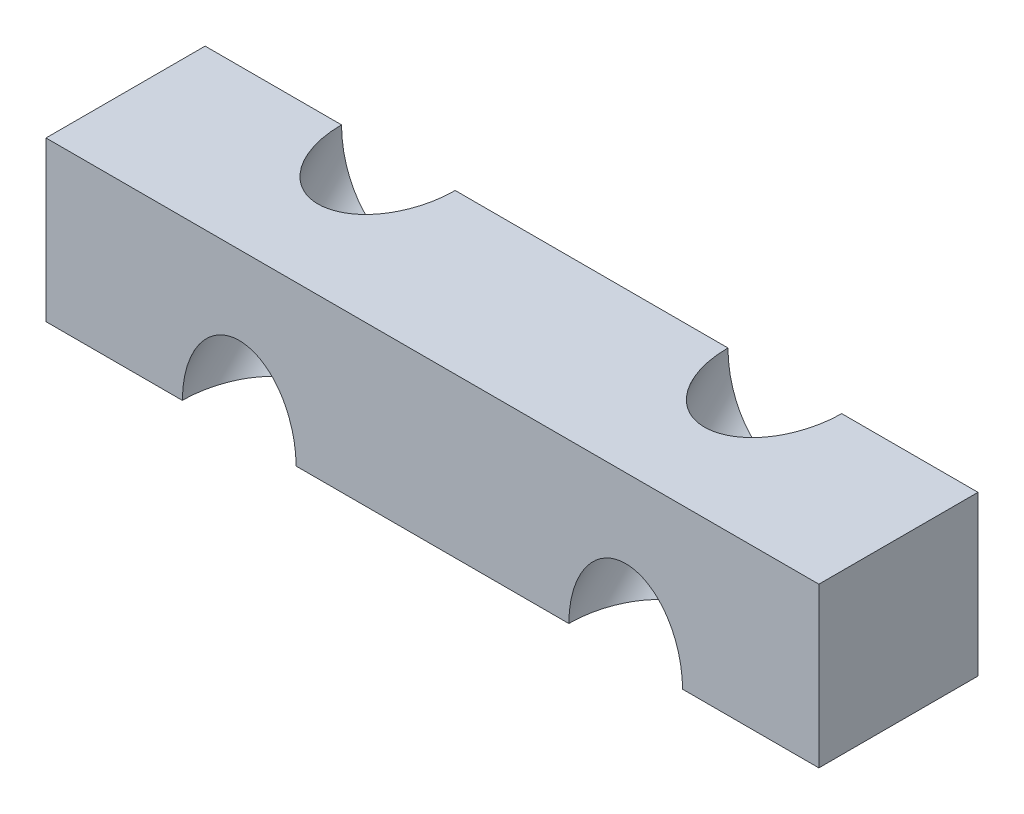
ISO-10303-21;
HEADER;
FILE_DESCRIPTION(('STEP AP214'),'2;1');
FILE_NAME('part.step','',(''),(''),'','','');
FILE_SCHEMA(('AUTOMOTIVE_DESIGN { 1 0 10303 214 1 1 1 1 }'));
ENDSEC;
DATA;
#1=APPLICATION_CONTEXT('core data for automotive mechanical design processes');
#2=APPLICATION_PROTOCOL_DEFINITION('international standard','automotive_design',2000,#1);
#3=PRODUCT_CONTEXT('',#1,'mechanical');
#4=PRODUCT('Part','Part','',(#3));
#5=PRODUCT_RELATED_PRODUCT_CATEGORY('part','',(#4));
#6=PRODUCT_DEFINITION_FORMATION('','',#4);
#7=PRODUCT_DEFINITION_CONTEXT('part definition',#1,'design');
#8=PRODUCT_DEFINITION('design','',#6,#7);
#9=PRODUCT_DEFINITION_SHAPE('','',#8);
#10=(LENGTH_UNIT() NAMED_UNIT(*) SI_UNIT(.MILLI.,.METRE.));
#11=(NAMED_UNIT(*) PLANE_ANGLE_UNIT() SI_UNIT($,.RADIAN.));
#12=(NAMED_UNIT(*) SI_UNIT($,.STERADIAN.) SOLID_ANGLE_UNIT());
#13=UNCERTAINTY_MEASURE_WITH_UNIT(LENGTH_MEASURE(1.E-05),#10,'distance_accuracy_value','');
#14=(GEOMETRIC_REPRESENTATION_CONTEXT(3) GLOBAL_UNCERTAINTY_ASSIGNED_CONTEXT((#13)) GLOBAL_UNIT_ASSIGNED_CONTEXT((#10,
#11,#12)) REPRESENTATION_CONTEXT('',''));
#15=CARTESIAN_POINT('',(0.,0.,0.));
#16=DIRECTION('',(0.,0.,1.));
#17=DIRECTION('',(1.,0.,0.));
#18=AXIS2_PLACEMENT_3D('',#15,#16,#17);
#19=CARTESIAN_POINT('',(0.,7.,0.));
#20=DIRECTION('',(1.,0.,0.));
#21=DIRECTION('',(0.,0.,-1.));
#22=AXIS2_PLACEMENT_3D('',#19,#20,#21);
#23=PLANE('',#22);
#24=DIRECTION('',(0.,0.,1.));
#25=VECTOR('',#24,1.);
#26=CARTESIAN_POINT('',(0.,0.,0.));
#27=LINE('',#26,#25);
#28=CARTESIAN_POINT('',(0.,0.,0.));
#29=VERTEX_POINT('',#28);
#30=CARTESIAN_POINT('',(0.,0.,7.));
#31=VERTEX_POINT('',#30);
#32=EDGE_CURVE('E127',#29,#31,#27,.T.);
#33=ORIENTED_EDGE('',*,*,#32,.T.);
#34=DIRECTION('',(0.,-1.,0.));
#35=VECTOR('',#34,1.);
#36=CARTESIAN_POINT('',(0.,7.,7.));
#37=LINE('',#36,#35);
#38=CARTESIAN_POINT('',(0.,7.,7.));
#39=VERTEX_POINT('',#38);
#40=EDGE_CURVE('E112',#39,#31,#37,.T.);
#41=ORIENTED_EDGE('',*,*,#40,.F.);
#42=DIRECTION('',(0.,0.,1.));
#43=VECTOR('',#42,1.);
#44=CARTESIAN_POINT('',(0.,7.,0.));
#45=LINE('',#44,#43);
#46=CARTESIAN_POINT('',(0.,7.,0.));
#47=VERTEX_POINT('',#46);
#48=EDGE_CURVE('E138',#47,#39,#45,.T.);
#49=ORIENTED_EDGE('',*,*,#48,.F.);
#50=DIRECTION('',(0.,-1.,0.));
#51=VECTOR('',#50,1.);
#52=CARTESIAN_POINT('',(0.,7.,0.));
#53=LINE('',#52,#51);
#54=EDGE_CURVE('E141',#47,#29,#53,.T.);
#55=ORIENTED_EDGE('',*,*,#54,.T.);
#56=EDGE_LOOP('',(#33,#41,#49,#55));
#57=FACE_BOUND('',#56,.T.);
#58=ADVANCED_FACE('F42',(#57),#23,.F.);
#59=CARTESIAN_POINT('',(0.,7.,7.));
#60=DIRECTION('',(0.,0.,-1.));
#61=DIRECTION('',(-1.,0.,0.));
#62=AXIS2_PLACEMENT_3D('',#59,#60,#61);
#63=PLANE('',#62);
#64=DIRECTION('',(1.,0.,0.));
#65=VECTOR('',#64,1.);
#66=CARTESIAN_POINT('',(0.,0.,7.));
#67=LINE('',#66,#65);
#68=CARTESIAN_POINT('',(6.,0.,7.));
#69=VERTEX_POINT('',#68);
#70=EDGE_CURVE('E129',#31,#69,#67,.T.);
#71=ORIENTED_EDGE('',*,*,#70,.T.);
#72=CARTESIAN_POINT('',(8.5,0.,7.));
#73=DIRECTION('',(0.,0.,-1.));
#74=DIRECTION('',(0.,1.,0.));
#75=AXIS2_PLACEMENT_3D('',#72,#73,#74);
#76=ELLIPSE('',#75,3.53553390593274,2.5);
#77=CARTESIAN_POINT('',(11.,0.,7.));
#78=VERTEX_POINT('',#77);
#79=EDGE_CURVE('E158',#69,#78,#76,.T.);
#80=ORIENTED_EDGE('',*,*,#79,.T.);
#81=CARTESIAN_POINT('',(23.,0.,7.));
#82=VERTEX_POINT('',#81);
#83=EDGE_CURVE('E120',#78,#82,#67,.T.);
#84=ORIENTED_EDGE('',*,*,#83,.T.);
#85=CARTESIAN_POINT('',(25.5,0.,7.));
#86=DIRECTION('',(0.,0.,-1.));
#87=DIRECTION('',(0.,1.,0.));
#88=AXIS2_PLACEMENT_3D('',#85,#86,#87);
#89=ELLIPSE('',#88,3.53553390593273,2.5);
#90=CARTESIAN_POINT('',(28.,0.,7.));
#91=VERTEX_POINT('',#90);
#92=EDGE_CURVE('E107',#82,#91,#89,.T.);
#93=ORIENTED_EDGE('',*,*,#92,.T.);
#94=CARTESIAN_POINT('',(34.,0.,7.));
#95=VERTEX_POINT('',#94);
#96=EDGE_CURVE('E117',#91,#95,#67,.T.);
#97=ORIENTED_EDGE('',*,*,#96,.T.);
#98=DIRECTION('',(0.,-1.,0.));
#99=VECTOR('',#98,1.);
#100=CARTESIAN_POINT('',(34.,7.,7.));
#101=LINE('',#100,#99);
#102=CARTESIAN_POINT('',(34.,7.,7.));
#103=VERTEX_POINT('',#102);
#104=EDGE_CURVE('E147',#103,#95,#101,.T.);
#105=ORIENTED_EDGE('',*,*,#104,.F.);
#106=DIRECTION('',(1.,0.,0.));
#107=VECTOR('',#106,1.);
#108=CARTESIAN_POINT('',(0.,7.,7.));
#109=LINE('',#108,#107);
#110=EDGE_CURVE('E150',#39,#103,#109,.T.);
#111=ORIENTED_EDGE('',*,*,#110,.F.);
#112=ORIENTED_EDGE('',*,*,#40,.T.);
#113=EDGE_LOOP('',(#71,#80,#84,#93,#97,#105,#111,#112));
#114=FACE_BOUND('',#113,.T.);
#115=ADVANCED_FACE('F115',(#114),#63,.F.);
#116=CARTESIAN_POINT('',(34.,7.,0.));
#117=DIRECTION('',(-1.,0.,0.));
#118=DIRECTION('',(0.,0.,1.));
#119=AXIS2_PLACEMENT_3D('',#116,#117,#118);
#120=PLANE('',#119);
#121=DIRECTION('',(0.,0.,-1.));
#122=VECTOR('',#121,1.);
#123=CARTESIAN_POINT('',(34.,0.,0.));
#124=LINE('',#123,#122);
#125=CARTESIAN_POINT('',(34.,0.,0.));
#126=VERTEX_POINT('',#125);
#127=EDGE_CURVE('E126',#95,#126,#124,.T.);
#128=ORIENTED_EDGE('',*,*,#127,.T.);
#129=DIRECTION('',(0.,-1.,0.));
#130=VECTOR('',#129,1.);
#131=CARTESIAN_POINT('',(34.,7.,0.));
#132=LINE('',#131,#130);
#133=CARTESIAN_POINT('',(34.,7.,0.));
#134=VERTEX_POINT('',#133);
#135=EDGE_CURVE('E144',#134,#126,#132,.T.);
#136=ORIENTED_EDGE('',*,*,#135,.F.);
#137=DIRECTION('',(0.,0.,-1.));
#138=VECTOR('',#137,1.);
#139=CARTESIAN_POINT('',(34.,7.,0.));
#140=LINE('',#139,#138);
#141=EDGE_CURVE('E168',#103,#134,#140,.T.);
#142=ORIENTED_EDGE('',*,*,#141,.F.);
#143=ORIENTED_EDGE('',*,*,#104,.T.);
#144=EDGE_LOOP('',(#128,#136,#142,#143));
#145=FACE_BOUND('',#144,.T.);
#146=ADVANCED_FACE('F181',(#145),#120,.F.);
#147=CARTESIAN_POINT('',(0.,7.,0.));
#148=DIRECTION('',(0.,0.,1.));
#149=DIRECTION('',(1.,0.,0.));
#150=AXIS2_PLACEMENT_3D('',#147,#148,#149);
#151=PLANE('',#150);
#152=DIRECTION('',(-1.,0.,0.));
#153=VECTOR('',#152,1.);
#154=CARTESIAN_POINT('',(0.,7.,0.));
#155=LINE('',#154,#153);
#156=CARTESIAN_POINT('',(6.,7.,0.));
#157=VERTEX_POINT('',#156);
#158=EDGE_CURVE('E170',#157,#47,#155,.T.);
#159=ORIENTED_EDGE('',*,*,#158,.F.);
#160=CARTESIAN_POINT('',(8.5,6.99999999999999,0.));
#161=DIRECTION('',(0.,0.,1.));
#162=DIRECTION('',(0.,1.,0.));
#163=AXIS2_PLACEMENT_3D('',#160,#161,#162);
#164=ELLIPSE('',#163,3.53553390593274,2.5);
#165=CARTESIAN_POINT('',(11.,7.,0.));
#166=VERTEX_POINT('',#165);
#167=EDGE_CURVE('E55',#157,#166,#164,.T.);
#168=ORIENTED_EDGE('',*,*,#167,.T.);
#169=CARTESIAN_POINT('',(23.,7.,0.));
#170=VERTEX_POINT('',#169);
#171=EDGE_CURVE('E172',#170,#166,#155,.T.);
#172=ORIENTED_EDGE('',*,*,#171,.F.);
#173=CARTESIAN_POINT('',(25.5,6.99999999999999,0.));
#174=DIRECTION('',(0.,0.,1.));
#175=DIRECTION('',(0.,1.,0.));
#176=AXIS2_PLACEMENT_3D('',#173,#174,#175);
#177=ELLIPSE('',#176,3.53553390593273,2.5);
#178=CARTESIAN_POINT('',(28.,7.,0.));
#179=VERTEX_POINT('',#178);
#180=EDGE_CURVE('E62',#170,#179,#177,.T.);
#181=ORIENTED_EDGE('',*,*,#180,.T.);
#182=EDGE_CURVE('E145',#134,#179,#155,.T.);
#183=ORIENTED_EDGE('',*,*,#182,.F.);
#184=ORIENTED_EDGE('',*,*,#135,.T.);
#185=DIRECTION('',(-1.,0.,0.));
#186=VECTOR('',#185,1.);
#187=CARTESIAN_POINT('',(0.,0.,0.));
#188=LINE('',#187,#186);
#189=EDGE_CURVE('E134',#126,#29,#188,.T.);
#190=ORIENTED_EDGE('',*,*,#189,.T.);
#191=ORIENTED_EDGE('',*,*,#54,.F.);
#192=EDGE_LOOP('',(#159,#168,#172,#181,#183,#184,#190,#191));
#193=FACE_BOUND('',#192,.T.);
#194=ADVANCED_FACE('F179',(#193),#151,.F.);
#195=CARTESIAN_POINT('',(0.,7.,0.));
#196=DIRECTION('',(0.,1.,0.));
#197=DIRECTION('',(0.,0.,1.));
#198=AXIS2_PLACEMENT_3D('',#195,#196,#197);
#199=PLANE('',#198);
#200=CARTESIAN_POINT('',(8.5,7.,0.));
#201=DIRECTION('',(0.,1.,0.));
#202=DIRECTION('',(0.,0.,-1.));
#203=AXIS2_PLACEMENT_3D('',#200,#201,#202);
#204=ELLIPSE('',#203,3.53553390593274,2.5);
#205=EDGE_CURVE('E159',#157,#166,#204,.T.);
#206=ORIENTED_EDGE('',*,*,#205,.F.);
#207=ORIENTED_EDGE('',*,*,#158,.T.);
#208=ORIENTED_EDGE('',*,*,#48,.T.);
#209=ORIENTED_EDGE('',*,*,#110,.T.);
#210=ORIENTED_EDGE('',*,*,#141,.T.);
#211=ORIENTED_EDGE('',*,*,#182,.T.);
#212=CARTESIAN_POINT('',(25.5,7.,0.));
#213=DIRECTION('',(0.,1.,0.));
#214=DIRECTION('',(0.,0.,-1.));
#215=AXIS2_PLACEMENT_3D('',#212,#213,#214);
#216=ELLIPSE('',#215,3.53553390593274,2.5);
#217=EDGE_CURVE('E121',#170,#179,#216,.T.);
#218=ORIENTED_EDGE('',*,*,#217,.F.);
#219=ORIENTED_EDGE('',*,*,#171,.T.);
#220=EDGE_LOOP('',(#206,#207,#208,#209,#210,#211,#218,#219));
#221=FACE_BOUND('',#220,.T.);
#222=ADVANCED_FACE('F177',(#221),#199,.T.);
#223=CARTESIAN_POINT('',(0.,0.,0.));
#224=DIRECTION('',(0.,1.,0.));
#225=DIRECTION('',(0.,0.,1.));
#226=AXIS2_PLACEMENT_3D('',#223,#224,#225);
#227=PLANE('',#226);
#228=ORIENTED_EDGE('',*,*,#83,.F.);
#229=CARTESIAN_POINT('',(8.5,0.,7.));
#230=DIRECTION('',(0.,1.,0.));
#231=DIRECTION('',(0.,0.,-1.));
#232=AXIS2_PLACEMENT_3D('',#229,#230,#231);
#233=ELLIPSE('',#232,3.53553390593274,2.5);
#234=EDGE_CURVE('E12',#78,#69,#233,.T.);
#235=ORIENTED_EDGE('',*,*,#234,.T.);
#236=ORIENTED_EDGE('',*,*,#70,.F.);
#237=ORIENTED_EDGE('',*,*,#32,.F.);
#238=ORIENTED_EDGE('',*,*,#189,.F.);
#239=ORIENTED_EDGE('',*,*,#127,.F.);
#240=ORIENTED_EDGE('',*,*,#96,.F.);
#241=CARTESIAN_POINT('',(25.5,0.,7.));
#242=DIRECTION('',(0.,1.,0.));
#243=DIRECTION('',(0.,0.,-1.));
#244=AXIS2_PLACEMENT_3D('',#241,#242,#243);
#245=ELLIPSE('',#244,3.53553390593274,2.5);
#246=EDGE_CURVE('E49',#91,#82,#245,.T.);
#247=ORIENTED_EDGE('',*,*,#246,.T.);
#248=EDGE_LOOP('',(#228,#235,#236,#237,#238,#239,#240,#247));
#249=FACE_BOUND('',#248,.T.);
#250=ADVANCED_FACE('F124',(#249),#227,.F.);
#251=CARTESIAN_POINT('',(25.5,0.,7.));
#252=DIRECTION('',(0.,0.707106781186547,-0.707106781186548));
#253=DIRECTION('',(0.,0.707106781186548,0.707106781186547));
#254=AXIS2_PLACEMENT_3D('',#251,#252,#253);
#255=CYLINDRICAL_SURFACE('',#254,2.5);
#256=ORIENTED_EDGE('',*,*,#246,.F.);
#257=ORIENTED_EDGE('',*,*,#92,.F.);
#258=EDGE_LOOP('',(#256,#257));
#259=FACE_BOUND('',#258,.T.);
#260=ORIENTED_EDGE('',*,*,#217,.T.);
#261=ORIENTED_EDGE('',*,*,#180,.F.);
#262=EDGE_LOOP('',(#260,#261));
#263=FACE_BOUND('',#262,.T.);
#264=ADVANCED_FACE('F106',(#259,#263),#255,.F.);
#265=CARTESIAN_POINT('',(8.5,0.,7.));
#266=DIRECTION('',(0.,0.707106781186547,-0.707106781186548));
#267=DIRECTION('',(0.,0.707106781186548,0.707106781186547));
#268=AXIS2_PLACEMENT_3D('',#265,#266,#267);
#269=CYLINDRICAL_SURFACE('',#268,2.5);
#270=ORIENTED_EDGE('',*,*,#234,.F.);
#271=ORIENTED_EDGE('',*,*,#79,.F.);
#272=EDGE_LOOP('',(#270,#271));
#273=FACE_BOUND('',#272,.T.);
#274=ORIENTED_EDGE('',*,*,#205,.T.);
#275=ORIENTED_EDGE('',*,*,#167,.F.);
#276=EDGE_LOOP('',(#274,#275));
#277=FACE_BOUND('',#276,.T.);
#278=ADVANCED_FACE('F157',(#273,#277),#269,.F.);
#279=CLOSED_SHELL('',(#58,#115,#146,#194,#222,#250,#264,#278));
#280=MANIFOLD_SOLID_BREP('B2',#279);
#281=ADVANCED_BREP_SHAPE_REPRESENTATION('',(#18,#280),#14);
#282=SHAPE_DEFINITION_REPRESENTATION(#9,#281);
ENDSEC;
END-ISO-10303-21;
